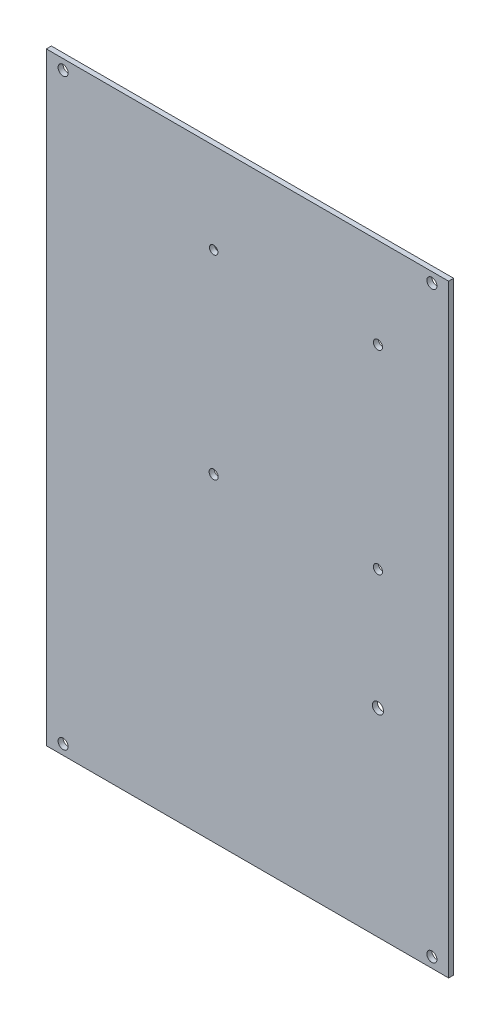
ISO-10303-21;
HEADER;
FILE_DESCRIPTION(('STEP AP214'),'2;1');
FILE_NAME('part.step','',(''),(''),'','','');
FILE_SCHEMA(('AUTOMOTIVE_DESIGN { 1 0 10303 214 1 1 1 1 }'));
ENDSEC;
DATA;
#1=APPLICATION_CONTEXT('core data for automotive mechanical design processes');
#2=APPLICATION_PROTOCOL_DEFINITION('international standard','automotive_design',2000,#1);
#3=PRODUCT_CONTEXT('',#1,'mechanical');
#4=PRODUCT('Part','Part','',(#3));
#5=PRODUCT_RELATED_PRODUCT_CATEGORY('part','',(#4));
#6=PRODUCT_DEFINITION_FORMATION('','',#4);
#7=PRODUCT_DEFINITION_CONTEXT('part definition',#1,'design');
#8=PRODUCT_DEFINITION('design','',#6,#7);
#9=PRODUCT_DEFINITION_SHAPE('','',#8);
#10=(LENGTH_UNIT() NAMED_UNIT(*) SI_UNIT(.MILLI.,.METRE.));
#11=(NAMED_UNIT(*) PLANE_ANGLE_UNIT() SI_UNIT($,.RADIAN.));
#12=(NAMED_UNIT(*) SI_UNIT($,.STERADIAN.) SOLID_ANGLE_UNIT());
#13=UNCERTAINTY_MEASURE_WITH_UNIT(LENGTH_MEASURE(1.E-05),#10,'distance_accuracy_value','');
#14=(GEOMETRIC_REPRESENTATION_CONTEXT(3) GLOBAL_UNCERTAINTY_ASSIGNED_CONTEXT((#13)) GLOBAL_UNIT_ASSIGNED_CONTEXT((#10,
#11,#12)) REPRESENTATION_CONTEXT('',''));
#15=CARTESIAN_POINT('',(0.,0.,0.));
#16=DIRECTION('',(0.,0.,1.));
#17=DIRECTION('',(1.,0.,0.));
#18=AXIS2_PLACEMENT_3D('',#15,#16,#17);
#19=CARTESIAN_POINT('',(820.026897687599,-0.193983282939536,2.25));
#20=DIRECTION('',(0.,0.,-1.));
#21=DIRECTION('',(-1.,0.,0.));
#22=AXIS2_PLACEMENT_3D('',#19,#20,#21);
#23=PLANE('',#22);
#24=DIRECTION('',(-1.,0.,0.));
#25=VECTOR('',#24,1.);
#26=CARTESIAN_POINT('',(851.172170155941,89.8060167170605,2.25));
#27=LINE('',#26,#25);
#28=CARTESIAN_POINT('',(971.172170155941,89.8060167170605,2.25));
#29=VERTEX_POINT('',#28);
#30=CARTESIAN_POINT('',(851.172170155941,89.8060167170605,2.25));
#31=VERTEX_POINT('',#30);
#32=EDGE_CURVE('E103',#29,#31,#27,.T.);
#33=ORIENTED_EDGE('',*,*,#32,.T.);
#34=DIRECTION('',(0.,-1.,0.));
#35=VECTOR('',#34,1.);
#36=CARTESIAN_POINT('',(851.172170155941,89.8060167170605,2.25));
#37=LINE('',#36,#35);
#38=CARTESIAN_POINT('',(851.172170155941,-90.1939832829396,2.25));
#39=VERTEX_POINT('',#38);
#40=EDGE_CURVE('E342',#31,#39,#37,.T.);
#41=ORIENTED_EDGE('',*,*,#40,.T.);
#42=DIRECTION('',(1.,0.,0.));
#43=VECTOR('',#42,1.);
#44=CARTESIAN_POINT('',(851.172170155941,-90.1939832829396,2.25));
#45=LINE('',#44,#43);
#46=CARTESIAN_POINT('',(971.172170155941,-90.1939832829396,2.25));
#47=VERTEX_POINT('',#46);
#48=EDGE_CURVE('E94',#39,#47,#45,.T.);
#49=ORIENTED_EDGE('',*,*,#48,.T.);
#50=DIRECTION('',(0.,1.,0.));
#51=VECTOR('',#50,1.);
#52=CARTESIAN_POINT('',(971.172170155941,89.8060167170605,2.25));
#53=LINE('',#52,#51);
#54=EDGE_CURVE('E59',#47,#29,#53,.T.);
#55=ORIENTED_EDGE('',*,*,#54,.T.);
#56=EDGE_LOOP('',(#33,#41,#49,#55));
#57=FACE_BOUND('',#56,.T.);
#58=CARTESIAN_POINT('',(950.083193315941,-31.0143599681951,2.25));
#59=DIRECTION('',(0.,0.,1.));
#60=DIRECTION('',(1.,0.,0.));
#61=AXIS2_PLACEMENT_3D('',#58,#59,#60);
#62=CIRCLE('',#61,1.65100000000001);
#63=CARTESIAN_POINT('',(951.734193315941,-31.0143599681951,2.25));
#64=VERTEX_POINT('',#63);
#65=EDGE_CURVE('E111',#64,#64,#62,.T.);
#66=ORIENTED_EDGE('',*,*,#65,.F.);
#67=EDGE_LOOP('',(#66));
#68=FACE_BOUND('',#67,.T.);
#69=CARTESIAN_POINT('',(856.172170155941,86.8060167170605,2.25));
#70=DIRECTION('',(0.,0.,1.));
#71=DIRECTION('',(1.,0.,0.));
#72=AXIS2_PLACEMENT_3D('',#69,#70,#71);
#73=CIRCLE('',#72,1.50000000000006);
#74=CARTESIAN_POINT('',(857.672170155941,86.8060167170605,2.25));
#75=VERTEX_POINT('',#74);
#76=EDGE_CURVE('E112',#75,#75,#73,.T.);
#77=ORIENTED_EDGE('',*,*,#76,.F.);
#78=EDGE_LOOP('',(#77));
#79=FACE_BOUND('',#78,.T.);
#80=CARTESIAN_POINT('',(901.083194265941,4.85544089388263,2.25));
#81=DIRECTION('',(0.,0.,1.));
#82=DIRECTION('',(1.,0.,0.));
#83=AXIS2_PLACEMENT_3D('',#80,#81,#82);
#84=CIRCLE('',#83,1.34999999999996);
#85=CARTESIAN_POINT('',(902.433194265941,4.85544089388263,2.25));
#86=VERTEX_POINT('',#85);
#87=EDGE_CURVE('E117',#86,#86,#84,.T.);
#88=ORIENTED_EDGE('',*,*,#87,.F.);
#89=EDGE_LOOP('',(#88));
#90=FACE_BOUND('',#89,.T.);
#91=CARTESIAN_POINT('',(950.083193315941,4.85544089388263,2.25));
#92=DIRECTION('',(0.,0.,1.));
#93=DIRECTION('',(1.,0.,0.));
#94=AXIS2_PLACEMENT_3D('',#91,#92,#93);
#95=CIRCLE('',#94,1.35000000000002);
#96=CARTESIAN_POINT('',(951.433193315941,4.85544089388263,2.25));
#97=VERTEX_POINT('',#96);
#98=EDGE_CURVE('E118',#97,#97,#95,.T.);
#99=ORIENTED_EDGE('',*,*,#98,.F.);
#100=EDGE_LOOP('',(#99));
#101=FACE_BOUND('',#100,.T.);
#102=CARTESIAN_POINT('',(950.083193315941,62.8468195682263,2.25));
#103=DIRECTION('',(0.,0.,1.));
#104=DIRECTION('',(1.,0.,0.));
#105=AXIS2_PLACEMENT_3D('',#102,#103,#104);
#106=CIRCLE('',#105,1.34999999999996);
#107=CARTESIAN_POINT('',(951.433193315941,62.8468195682263,2.25));
#108=VERTEX_POINT('',#107);
#109=EDGE_CURVE('E123',#108,#108,#106,.T.);
#110=ORIENTED_EDGE('',*,*,#109,.F.);
#111=EDGE_LOOP('',(#110));
#112=FACE_BOUND('',#111,.T.);
#113=CARTESIAN_POINT('',(901.083194265941,62.8468196030872,2.25));
#114=DIRECTION('',(0.,0.,1.));
#115=DIRECTION('',(1.,0.,0.));
#116=AXIS2_PLACEMENT_3D('',#113,#114,#115);
#117=CIRCLE('',#116,1.25000000000014);
#118=CARTESIAN_POINT('',(902.333194265941,62.8468196030872,2.25));
#119=VERTEX_POINT('',#118);
#120=EDGE_CURVE('E124',#119,#119,#117,.T.);
#121=ORIENTED_EDGE('',*,*,#120,.F.);
#122=EDGE_LOOP('',(#121));
#123=FACE_BOUND('',#122,.T.);
#124=CARTESIAN_POINT('',(966.172170155941,86.8060167170604,2.25));
#125=DIRECTION('',(0.,0.,1.));
#126=DIRECTION('',(1.,0.,0.));
#127=AXIS2_PLACEMENT_3D('',#124,#125,#126);
#128=CIRCLE('',#127,1.50000000000006);
#129=CARTESIAN_POINT('',(967.672170155941,86.8060167170604,2.25));
#130=VERTEX_POINT('',#129);
#131=EDGE_CURVE('E129',#130,#130,#128,.T.);
#132=ORIENTED_EDGE('',*,*,#131,.F.);
#133=EDGE_LOOP('',(#132));
#134=FACE_BOUND('',#133,.T.);
#135=CARTESIAN_POINT('',(856.172170155941,-87.1939832829396,2.25));
#136=DIRECTION('',(0.,0.,1.));
#137=DIRECTION('',(1.,0.,0.));
#138=AXIS2_PLACEMENT_3D('',#135,#136,#137);
#139=CIRCLE('',#138,1.50000000000006);
#140=CARTESIAN_POINT('',(857.672170155941,-87.1939832829396,2.25));
#141=VERTEX_POINT('',#140);
#142=EDGE_CURVE('E130',#141,#141,#139,.T.);
#143=ORIENTED_EDGE('',*,*,#142,.F.);
#144=EDGE_LOOP('',(#143));
#145=FACE_BOUND('',#144,.T.);
#146=CARTESIAN_POINT('',(966.172170155941,-87.1939832829396,2.25));
#147=DIRECTION('',(0.,0.,1.));
#148=DIRECTION('',(1.,0.,0.));
#149=AXIS2_PLACEMENT_3D('',#146,#147,#148);
#150=CIRCLE('',#149,1.50000000000006);
#151=CARTESIAN_POINT('',(967.672170155941,-87.1939832829396,2.25));
#152=VERTEX_POINT('',#151);
#153=EDGE_CURVE('E134',#152,#152,#150,.T.);
#154=ORIENTED_EDGE('',*,*,#153,.F.);
#155=EDGE_LOOP('',(#154));
#156=FACE_BOUND('',#155,.T.);
#157=ADVANCED_FACE('F39',(#57,#68,#79,#90,#101,#112,#123,#134,#145,#156),#23,.F.);
#158=CARTESIAN_POINT('',(820.026897687599,-0.193983282939536,0.75));
#159=DIRECTION('',(0.,0.,-1.));
#160=DIRECTION('',(-1.,0.,0.));
#161=AXIS2_PLACEMENT_3D('',#158,#159,#160);
#162=PLANE('',#161);
#163=CARTESIAN_POINT('',(856.172170155941,-87.1939832829396,0.75));
#164=DIRECTION('',(0.,0.,1.));
#165=DIRECTION('',(0.,-1.,0.));
#166=AXIS2_PLACEMENT_3D('',#163,#164,#165);
#167=CIRCLE('',#166,1.50000000000006);
#168=CARTESIAN_POINT('',(856.172170155941,-88.6939832829397,0.75));
#169=VERTEX_POINT('',#168);
#170=EDGE_CURVE('E139',#169,#169,#167,.T.);
#171=ORIENTED_EDGE('',*,*,#170,.T.);
#172=EDGE_LOOP('',(#171));
#173=FACE_BOUND('',#172,.T.);
#174=CARTESIAN_POINT('',(901.083194265941,62.8468196030872,0.75));
#175=DIRECTION('',(0.,0.,1.));
#176=DIRECTION('',(0.,-1.,0.));
#177=AXIS2_PLACEMENT_3D('',#174,#175,#176);
#178=CIRCLE('',#177,1.25000000000014);
#179=CARTESIAN_POINT('',(901.083194265941,61.5968196030871,0.75));
#180=VERTEX_POINT('',#179);
#181=EDGE_CURVE('E155',#180,#180,#178,.T.);
#182=ORIENTED_EDGE('',*,*,#181,.T.);
#183=EDGE_LOOP('',(#182));
#184=FACE_BOUND('',#183,.T.);
#185=CARTESIAN_POINT('',(950.083193315941,4.85544089388263,0.75));
#186=DIRECTION('',(0.,0.,1.));
#187=DIRECTION('',(0.,-1.,0.));
#188=AXIS2_PLACEMENT_3D('',#185,#186,#187);
#189=CIRCLE('',#188,1.35000000000002);
#190=CARTESIAN_POINT('',(950.083193315941,3.50544089388262,0.75));
#191=VERTEX_POINT('',#190);
#192=EDGE_CURVE('E159',#191,#191,#189,.T.);
#193=ORIENTED_EDGE('',*,*,#192,.T.);
#194=EDGE_LOOP('',(#193));
#195=FACE_BOUND('',#194,.T.);
#196=CARTESIAN_POINT('',(856.172170155941,86.8060167170605,0.75));
#197=DIRECTION('',(0.,0.,1.));
#198=DIRECTION('',(0.,-1.,0.));
#199=AXIS2_PLACEMENT_3D('',#196,#197,#198);
#200=CIRCLE('',#199,1.50000000000006);
#201=CARTESIAN_POINT('',(856.172170155941,85.3060167170604,0.75));
#202=VERTEX_POINT('',#201);
#203=EDGE_CURVE('E162',#202,#202,#200,.T.);
#204=ORIENTED_EDGE('',*,*,#203,.T.);
#205=EDGE_LOOP('',(#204));
#206=FACE_BOUND('',#205,.T.);
#207=DIRECTION('',(-1.,0.,0.));
#208=VECTOR('',#207,1.);
#209=CARTESIAN_POINT('',(851.172170155941,89.8060167170605,0.75));
#210=LINE('',#209,#208);
#211=CARTESIAN_POINT('',(971.172170155941,89.8060167170605,0.75));
#212=VERTEX_POINT('',#211);
#213=CARTESIAN_POINT('',(851.172170155941,89.8060167170605,0.75));
#214=VERTEX_POINT('',#213);
#215=EDGE_CURVE('E88',#212,#214,#210,.T.);
#216=ORIENTED_EDGE('',*,*,#215,.F.);
#217=DIRECTION('',(0.,1.,0.));
#218=VECTOR('',#217,1.);
#219=CARTESIAN_POINT('',(971.172170155941,89.8060167170605,0.75));
#220=LINE('',#219,#218);
#221=CARTESIAN_POINT('',(971.172170155941,-90.1939832829396,0.75));
#222=VERTEX_POINT('',#221);
#223=EDGE_CURVE('E99',#222,#212,#220,.T.);
#224=ORIENTED_EDGE('',*,*,#223,.F.);
#225=DIRECTION('',(1.,0.,0.));
#226=VECTOR('',#225,1.);
#227=CARTESIAN_POINT('',(851.172170155941,-90.1939832829396,0.75));
#228=LINE('',#227,#226);
#229=CARTESIAN_POINT('',(851.172170155941,-90.1939832829396,0.75));
#230=VERTEX_POINT('',#229);
#231=EDGE_CURVE('E87',#230,#222,#228,.T.);
#232=ORIENTED_EDGE('',*,*,#231,.F.);
#233=DIRECTION('',(0.,-1.,0.));
#234=VECTOR('',#233,1.);
#235=CARTESIAN_POINT('',(851.172170155941,89.8060167170605,0.75));
#236=LINE('',#235,#234);
#237=EDGE_CURVE('E77',#214,#230,#236,.T.);
#238=ORIENTED_EDGE('',*,*,#237,.F.);
#239=EDGE_LOOP('',(#216,#224,#232,#238));
#240=FACE_BOUND('',#239,.T.);
#241=CARTESIAN_POINT('',(950.083193315941,-31.0143599681951,0.75));
#242=DIRECTION('',(0.,0.,1.));
#243=DIRECTION('',(0.,-1.,0.));
#244=AXIS2_PLACEMENT_3D('',#241,#242,#243);
#245=CIRCLE('',#244,1.65100000000001);
#246=CARTESIAN_POINT('',(950.083193315941,-32.6653599681951,0.75));
#247=VERTEX_POINT('',#246);
#248=EDGE_CURVE('E107',#247,#247,#245,.T.);
#249=ORIENTED_EDGE('',*,*,#248,.T.);
#250=EDGE_LOOP('',(#249));
#251=FACE_BOUND('',#250,.T.);
#252=CARTESIAN_POINT('',(901.083194265941,4.85544089388263,0.75));
#253=DIRECTION('',(0.,0.,1.));
#254=DIRECTION('',(0.,-1.,0.));
#255=AXIS2_PLACEMENT_3D('',#252,#253,#254);
#256=CIRCLE('',#255,1.34999999999996);
#257=CARTESIAN_POINT('',(901.083194265941,3.50544089388267,0.75));
#258=VERTEX_POINT('',#257);
#259=EDGE_CURVE('E113',#258,#258,#256,.T.);
#260=ORIENTED_EDGE('',*,*,#259,.T.);
#261=EDGE_LOOP('',(#260));
#262=FACE_BOUND('',#261,.T.);
#263=CARTESIAN_POINT('',(950.083193315941,62.8468195682263,0.75));
#264=DIRECTION('',(0.,0.,1.));
#265=DIRECTION('',(0.,-1.,0.));
#266=AXIS2_PLACEMENT_3D('',#263,#264,#265);
#267=CIRCLE('',#266,1.34999999999996);
#268=CARTESIAN_POINT('',(950.083193315941,61.4968195682263,0.75));
#269=VERTEX_POINT('',#268);
#270=EDGE_CURVE('E119',#269,#269,#267,.T.);
#271=ORIENTED_EDGE('',*,*,#270,.T.);
#272=EDGE_LOOP('',(#271));
#273=FACE_BOUND('',#272,.T.);
#274=CARTESIAN_POINT('',(966.172170155941,86.8060167170604,0.75));
#275=DIRECTION('',(0.,0.,1.));
#276=DIRECTION('',(0.,-1.,0.));
#277=AXIS2_PLACEMENT_3D('',#274,#275,#276);
#278=CIRCLE('',#277,1.50000000000006);
#279=CARTESIAN_POINT('',(966.172170155941,85.3060167170604,0.75));
#280=VERTEX_POINT('',#279);
#281=EDGE_CURVE('E125',#280,#280,#278,.T.);
#282=ORIENTED_EDGE('',*,*,#281,.T.);
#283=EDGE_LOOP('',(#282));
#284=FACE_BOUND('',#283,.T.);
#285=CARTESIAN_POINT('',(966.172170155941,-87.1939832829396,0.75));
#286=DIRECTION('',(0.,0.,1.));
#287=DIRECTION('',(0.,-1.,0.));
#288=AXIS2_PLACEMENT_3D('',#285,#286,#287);
#289=CIRCLE('',#288,1.50000000000006);
#290=CARTESIAN_POINT('',(966.172170155941,-88.6939832829396,0.75));
#291=VERTEX_POINT('',#290);
#292=EDGE_CURVE('E131',#291,#291,#289,.T.);
#293=ORIENTED_EDGE('',*,*,#292,.T.);
#294=EDGE_LOOP('',(#293));
#295=FACE_BOUND('',#294,.T.);
#296=ADVANCED_FACE('F97',(#173,#184,#195,#206,#240,#251,#262,#273,#284,#295),#162,.T.);
#297=CARTESIAN_POINT('',(851.172170155941,89.8060167170605,2.25));
#298=DIRECTION('',(0.,-1.,0.));
#299=DIRECTION('',(0.,0.,-1.));
#300=AXIS2_PLACEMENT_3D('',#297,#298,#299);
#301=PLANE('',#300);
#302=ORIENTED_EDGE('',*,*,#215,.T.);
#303=DIRECTION('',(0.,0.,-1.));
#304=VECTOR('',#303,1.);
#305=CARTESIAN_POINT('',(851.172170155941,89.8060167170605,2.25));
#306=LINE('',#305,#304);
#307=EDGE_CURVE('E11',#31,#214,#306,.T.);
#308=ORIENTED_EDGE('',*,*,#307,.F.);
#309=ORIENTED_EDGE('',*,*,#32,.F.);
#310=DIRECTION('',(0.,0.,-1.));
#311=VECTOR('',#310,1.);
#312=CARTESIAN_POINT('',(971.172170155941,89.8060167170605,2.25));
#313=LINE('',#312,#311);
#314=EDGE_CURVE('E151',#29,#212,#313,.T.);
#315=ORIENTED_EDGE('',*,*,#314,.T.);
#316=EDGE_LOOP('',(#302,#308,#309,#315));
#317=FACE_BOUND('',#316,.T.);
#318=ADVANCED_FACE('F207',(#317),#301,.F.);
#319=CARTESIAN_POINT('',(851.172170155941,89.8060167170605,2.25));
#320=DIRECTION('',(1.,0.,0.));
#321=DIRECTION('',(0.,0.,-1.));
#322=AXIS2_PLACEMENT_3D('',#319,#320,#321);
#323=PLANE('',#322);
#324=ORIENTED_EDGE('',*,*,#237,.T.);
#325=DIRECTION('',(0.,0.,-1.));
#326=VECTOR('',#325,1.);
#327=CARTESIAN_POINT('',(851.172170155941,-90.1939832829396,2.25));
#328=LINE('',#327,#326);
#329=EDGE_CURVE('E50',#39,#230,#328,.T.);
#330=ORIENTED_EDGE('',*,*,#329,.F.);
#331=ORIENTED_EDGE('',*,*,#40,.F.);
#332=ORIENTED_EDGE('',*,*,#307,.T.);
#333=EDGE_LOOP('',(#324,#330,#331,#332));
#334=FACE_BOUND('',#333,.T.);
#335=ADVANCED_FACE('F81',(#334),#323,.F.);
#336=CARTESIAN_POINT('',(851.172170155941,-90.1939832829396,2.25));
#337=DIRECTION('',(0.,1.,0.));
#338=DIRECTION('',(0.,0.,1.));
#339=AXIS2_PLACEMENT_3D('',#336,#337,#338);
#340=PLANE('',#339);
#341=ORIENTED_EDGE('',*,*,#231,.T.);
#342=DIRECTION('',(0.,0.,-1.));
#343=VECTOR('',#342,1.);
#344=CARTESIAN_POINT('',(971.172170155941,-90.1939832829396,2.25));
#345=LINE('',#344,#343);
#346=EDGE_CURVE('E43',#47,#222,#345,.T.);
#347=ORIENTED_EDGE('',*,*,#346,.F.);
#348=ORIENTED_EDGE('',*,*,#48,.F.);
#349=ORIENTED_EDGE('',*,*,#329,.T.);
#350=EDGE_LOOP('',(#341,#347,#348,#349));
#351=FACE_BOUND('',#350,.T.);
#352=ADVANCED_FACE('F91',(#351),#340,.F.);
#353=CARTESIAN_POINT('',(971.172170155941,89.8060167170605,2.25));
#354=DIRECTION('',(-1.,0.,0.));
#355=DIRECTION('',(0.,0.,1.));
#356=AXIS2_PLACEMENT_3D('',#353,#354,#355);
#357=PLANE('',#356);
#358=ORIENTED_EDGE('',*,*,#223,.T.);
#359=ORIENTED_EDGE('',*,*,#314,.F.);
#360=ORIENTED_EDGE('',*,*,#54,.F.);
#361=ORIENTED_EDGE('',*,*,#346,.T.);
#362=EDGE_LOOP('',(#358,#359,#360,#361));
#363=FACE_BOUND('',#362,.T.);
#364=ADVANCED_FACE('F287',(#363),#357,.F.);
#365=CARTESIAN_POINT('',(950.083193315941,-31.0143599681951,2.25));
#366=DIRECTION('',(0.,0.,-1.));
#367=DIRECTION('',(-1.,0.,0.));
#368=AXIS2_PLACEMENT_3D('',#365,#366,#367);
#369=CYLINDRICAL_SURFACE('',#368,1.65100000000001);
#370=ORIENTED_EDGE('',*,*,#65,.T.);
#371=EDGE_LOOP('',(#370));
#372=FACE_BOUND('',#371,.T.);
#373=ORIENTED_EDGE('',*,*,#248,.F.);
#374=EDGE_LOOP('',(#373));
#375=FACE_BOUND('',#374,.T.);
#376=ADVANCED_FACE('F279',(#372,#375),#369,.F.);
#377=CARTESIAN_POINT('',(856.172170155941,86.8060167170605,2.25));
#378=DIRECTION('',(0.,0.,-1.));
#379=DIRECTION('',(-1.,0.,0.));
#380=AXIS2_PLACEMENT_3D('',#377,#378,#379);
#381=CYLINDRICAL_SURFACE('',#380,1.50000000000006);
#382=ORIENTED_EDGE('',*,*,#76,.T.);
#383=EDGE_LOOP('',(#382));
#384=FACE_BOUND('',#383,.T.);
#385=ORIENTED_EDGE('',*,*,#203,.F.);
#386=EDGE_LOOP('',(#385));
#387=FACE_BOUND('',#386,.T.);
#388=ADVANCED_FACE('F226',(#384,#387),#381,.F.);
#389=CARTESIAN_POINT('',(901.083194265941,4.85544089388263,2.25));
#390=DIRECTION('',(0.,0.,-1.));
#391=DIRECTION('',(-1.,0.,0.));
#392=AXIS2_PLACEMENT_3D('',#389,#390,#391);
#393=CYLINDRICAL_SURFACE('',#392,1.34999999999996);
#394=ORIENTED_EDGE('',*,*,#87,.T.);
#395=EDGE_LOOP('',(#394));
#396=FACE_BOUND('',#395,.T.);
#397=ORIENTED_EDGE('',*,*,#259,.F.);
#398=EDGE_LOOP('',(#397));
#399=FACE_BOUND('',#398,.T.);
#400=ADVANCED_FACE('F216',(#396,#399),#393,.F.);
#401=CARTESIAN_POINT('',(950.083193315941,4.85544089388263,2.25));
#402=DIRECTION('',(0.,0.,-1.));
#403=DIRECTION('',(-1.,0.,0.));
#404=AXIS2_PLACEMENT_3D('',#401,#402,#403);
#405=CYLINDRICAL_SURFACE('',#404,1.35000000000002);
#406=ORIENTED_EDGE('',*,*,#98,.T.);
#407=EDGE_LOOP('',(#406));
#408=FACE_BOUND('',#407,.T.);
#409=ORIENTED_EDGE('',*,*,#192,.F.);
#410=EDGE_LOOP('',(#409));
#411=FACE_BOUND('',#410,.T.);
#412=ADVANCED_FACE('F213',(#408,#411),#405,.F.);
#413=CARTESIAN_POINT('',(950.083193315941,62.8468195682263,2.25));
#414=DIRECTION('',(0.,0.,-1.));
#415=DIRECTION('',(-1.,0.,0.));
#416=AXIS2_PLACEMENT_3D('',#413,#414,#415);
#417=CYLINDRICAL_SURFACE('',#416,1.34999999999996);
#418=ORIENTED_EDGE('',*,*,#109,.T.);
#419=EDGE_LOOP('',(#418));
#420=FACE_BOUND('',#419,.T.);
#421=ORIENTED_EDGE('',*,*,#270,.F.);
#422=EDGE_LOOP('',(#421));
#423=FACE_BOUND('',#422,.T.);
#424=ADVANCED_FACE('F215',(#420,#423),#417,.F.);
#425=CARTESIAN_POINT('',(901.083194265941,62.8468196030872,2.25));
#426=DIRECTION('',(0.,0.,-1.));
#427=DIRECTION('',(-1.,0.,0.));
#428=AXIS2_PLACEMENT_3D('',#425,#426,#427);
#429=CYLINDRICAL_SURFACE('',#428,1.25000000000014);
#430=ORIENTED_EDGE('',*,*,#120,.T.);
#431=EDGE_LOOP('',(#430));
#432=FACE_BOUND('',#431,.T.);
#433=ORIENTED_EDGE('',*,*,#181,.F.);
#434=EDGE_LOOP('',(#433));
#435=FACE_BOUND('',#434,.T.);
#436=ADVANCED_FACE('F223',(#432,#435),#429,.F.);
#437=CARTESIAN_POINT('',(966.172170155941,86.8060167170604,2.25));
#438=DIRECTION('',(0.,0.,-1.));
#439=DIRECTION('',(-1.,0.,0.));
#440=AXIS2_PLACEMENT_3D('',#437,#438,#439);
#441=CYLINDRICAL_SURFACE('',#440,1.50000000000006);
#442=ORIENTED_EDGE('',*,*,#131,.T.);
#443=EDGE_LOOP('',(#442));
#444=FACE_BOUND('',#443,.T.);
#445=ORIENTED_EDGE('',*,*,#281,.F.);
#446=EDGE_LOOP('',(#445));
#447=FACE_BOUND('',#446,.T.);
#448=ADVANCED_FACE('F189',(#444,#447),#441,.F.);
#449=CARTESIAN_POINT('',(856.172170155941,-87.1939832829396,2.25));
#450=DIRECTION('',(0.,0.,-1.));
#451=DIRECTION('',(-1.,0.,0.));
#452=AXIS2_PLACEMENT_3D('',#449,#450,#451);
#453=CYLINDRICAL_SURFACE('',#452,1.50000000000006);
#454=ORIENTED_EDGE('',*,*,#142,.T.);
#455=EDGE_LOOP('',(#454));
#456=FACE_BOUND('',#455,.T.);
#457=ORIENTED_EDGE('',*,*,#170,.F.);
#458=EDGE_LOOP('',(#457));
#459=FACE_BOUND('',#458,.T.);
#460=ADVANCED_FACE('F200',(#456,#459),#453,.F.);
#461=CARTESIAN_POINT('',(966.172170155941,-87.1939832829396,2.25));
#462=DIRECTION('',(0.,0.,-1.));
#463=DIRECTION('',(-1.,0.,0.));
#464=AXIS2_PLACEMENT_3D('',#461,#462,#463);
#465=CYLINDRICAL_SURFACE('',#464,1.50000000000006);
#466=ORIENTED_EDGE('',*,*,#153,.T.);
#467=EDGE_LOOP('',(#466));
#468=FACE_BOUND('',#467,.T.);
#469=ORIENTED_EDGE('',*,*,#292,.F.);
#470=EDGE_LOOP('',(#469));
#471=FACE_BOUND('',#470,.T.);
#472=ADVANCED_FACE('F41',(#468,#471),#465,.F.);
#473=CLOSED_SHELL('',(#157,#296,#318,#335,#352,#364,#376,#388,#400,#412,#424,#436,#448,#460,#472));
#474=MANIFOLD_SOLID_BREP('B2',#473);
#475=ADVANCED_BREP_SHAPE_REPRESENTATION('',(#18,#474),#14);
#476=SHAPE_DEFINITION_REPRESENTATION(#9,#475);
ENDSEC;
END-ISO-10303-21;
